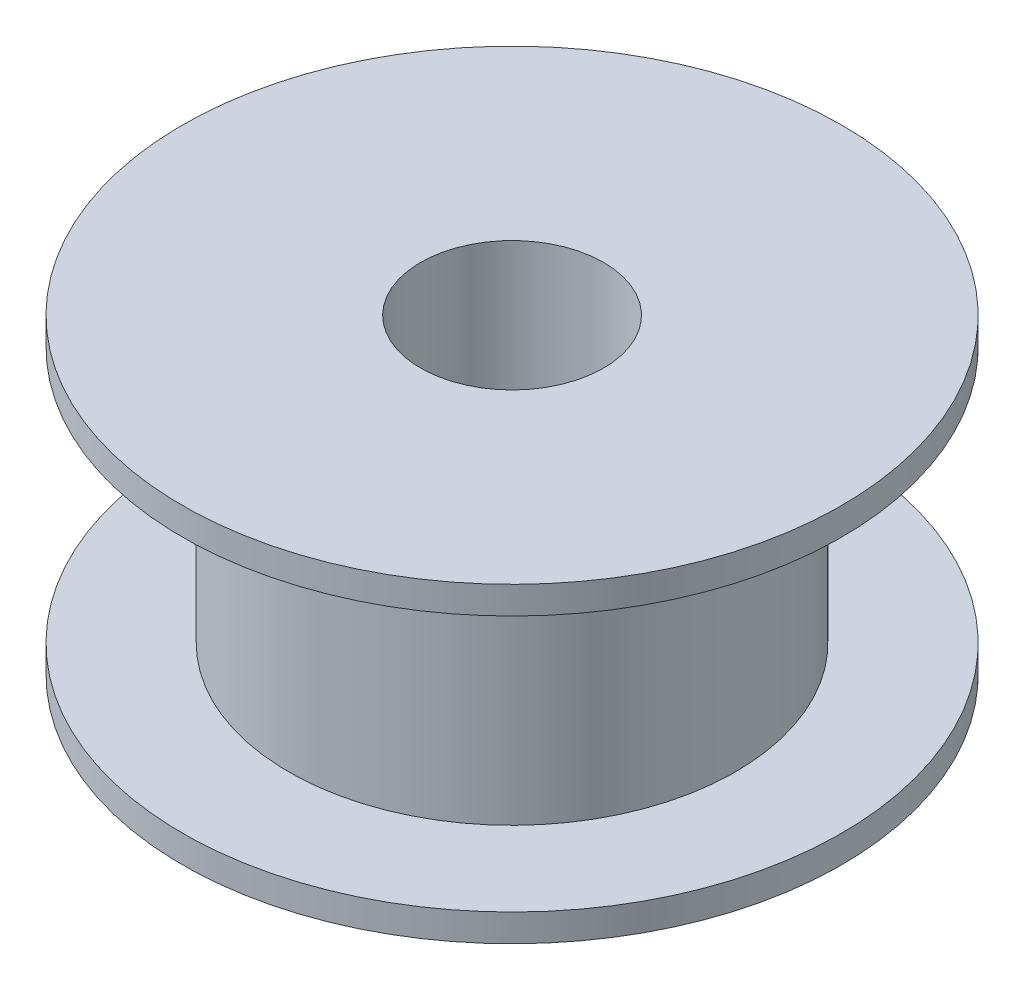
ISO-10303-21;
HEADER;
FILE_DESCRIPTION(('STEP AP214'),'2;1');
FILE_NAME('part.step','',(''),(''),'','','');
FILE_SCHEMA(('AUTOMOTIVE_DESIGN { 1 0 10303 214 1 1 1 1 }'));
ENDSEC;
DATA;
#1=APPLICATION_CONTEXT('core data for automotive mechanical design processes');
#2=APPLICATION_PROTOCOL_DEFINITION('international standard','automotive_design',2000,#1);
#3=PRODUCT_CONTEXT('',#1,'mechanical');
#4=PRODUCT('Part','Part','',(#3));
#5=PRODUCT_RELATED_PRODUCT_CATEGORY('part','',(#4));
#6=PRODUCT_DEFINITION_FORMATION('','',#4);
#7=PRODUCT_DEFINITION_CONTEXT('part definition',#1,'design');
#8=PRODUCT_DEFINITION('design','',#6,#7);
#9=PRODUCT_DEFINITION_SHAPE('','',#8);
#10=(LENGTH_UNIT() NAMED_UNIT(*) SI_UNIT(.MILLI.,.METRE.));
#11=(NAMED_UNIT(*) PLANE_ANGLE_UNIT() SI_UNIT($,.RADIAN.));
#12=(NAMED_UNIT(*) SI_UNIT($,.STERADIAN.) SOLID_ANGLE_UNIT());
#13=UNCERTAINTY_MEASURE_WITH_UNIT(LENGTH_MEASURE(1.E-05),#10,'distance_accuracy_value','');
#14=(GEOMETRIC_REPRESENTATION_CONTEXT(3) GLOBAL_UNCERTAINTY_ASSIGNED_CONTEXT((#13)) GLOBAL_UNIT_ASSIGNED_CONTEXT((#10,
#11,#12)) REPRESENTATION_CONTEXT('',''));
#15=CARTESIAN_POINT('',(0.,0.,0.));
#16=DIRECTION('',(0.,0.,1.));
#17=DIRECTION('',(1.,0.,0.));
#18=AXIS2_PLACEMENT_3D('',#15,#16,#17);
#19=CARTESIAN_POINT('',(9.,0.,0.));
#20=DIRECTION('',(0.,-1.,0.));
#21=DIRECTION('',(0.,0.,-1.));
#22=AXIS2_PLACEMENT_3D('',#19,#20,#21);
#23=PLANE('',#22);
#24=CARTESIAN_POINT('',(0.,0.,0.));
#25=DIRECTION('',(0.,-1.,0.));
#26=DIRECTION('',(0.,0.,-1.));
#27=AXIS2_PLACEMENT_3D('',#24,#25,#26);
#28=CIRCLE('',#27,9.);
#29=CARTESIAN_POINT('',(0.,0.,-9.));
#30=VERTEX_POINT('',#29);
#31=EDGE_CURVE('E72',#30,#30,#28,.T.);
#32=ORIENTED_EDGE('',*,*,#31,.T.);
#33=EDGE_LOOP('',(#32));
#34=FACE_BOUND('',#33,.T.);
#35=CARTESIAN_POINT('',(0.,0.,0.));
#36=DIRECTION('',(0.,-1.,0.));
#37=DIRECTION('',(0.,0.,-1.));
#38=AXIS2_PLACEMENT_3D('',#35,#36,#37);
#39=CIRCLE('',#38,2.5);
#40=CARTESIAN_POINT('',(0.,0.,-2.5));
#41=VERTEX_POINT('',#40);
#42=EDGE_CURVE('E10',#41,#41,#39,.T.);
#43=ORIENTED_EDGE('',*,*,#42,.F.);
#44=EDGE_LOOP('',(#43));
#45=FACE_BOUND('',#44,.T.);
#46=ADVANCED_FACE('F36',(#34,#45),#23,.T.);
#47=CARTESIAN_POINT('',(0.,0.,0.));
#48=DIRECTION('',(0.,-1.,0.));
#49=DIRECTION('',(0.,0.,-1.));
#50=AXIS2_PLACEMENT_3D('',#47,#48,#49);
#51=CYLINDRICAL_SURFACE('',#50,2.5);
#52=ORIENTED_EDGE('',*,*,#42,.T.);
#53=EDGE_LOOP('',(#52));
#54=FACE_BOUND('',#53,.T.);
#55=CARTESIAN_POINT('',(0.,8.5,0.));
#56=DIRECTION('',(0.,-1.,0.));
#57=DIRECTION('',(0.,0.,-1.));
#58=AXIS2_PLACEMENT_3D('',#55,#56,#57);
#59=CIRCLE('',#58,2.5);
#60=CARTESIAN_POINT('',(0.,8.5,-2.5));
#61=VERTEX_POINT('',#60);
#62=EDGE_CURVE('E43',#61,#61,#59,.T.);
#63=ORIENTED_EDGE('',*,*,#62,.F.);
#64=EDGE_LOOP('',(#63));
#65=FACE_BOUND('',#64,.T.);
#66=ADVANCED_FACE('F91',(#54,#65),#51,.F.);
#67=CARTESIAN_POINT('',(2.5,8.5,0.));
#68=DIRECTION('',(0.,1.,0.));
#69=DIRECTION('',(0.,0.,1.));
#70=AXIS2_PLACEMENT_3D('',#67,#68,#69);
#71=PLANE('',#70);
#72=ORIENTED_EDGE('',*,*,#62,.T.);
#73=EDGE_LOOP('',(#72));
#74=FACE_BOUND('',#73,.T.);
#75=CARTESIAN_POINT('',(0.,8.5,0.));
#76=DIRECTION('',(0.,-1.,0.));
#77=DIRECTION('',(0.,0.,-1.));
#78=AXIS2_PLACEMENT_3D('',#75,#76,#77);
#79=CIRCLE('',#78,9.);
#80=CARTESIAN_POINT('',(0.,8.5,-9.));
#81=VERTEX_POINT('',#80);
#82=EDGE_CURVE('E50',#81,#81,#79,.T.);
#83=ORIENTED_EDGE('',*,*,#82,.F.);
#84=EDGE_LOOP('',(#83));
#85=FACE_BOUND('',#84,.T.);
#86=ADVANCED_FACE('F95',(#74,#85),#71,.T.);
#87=CARTESIAN_POINT('',(0.,0.,0.));
#88=DIRECTION('',(0.,-1.,0.));
#89=DIRECTION('',(0.,0.,-1.));
#90=AXIS2_PLACEMENT_3D('',#87,#88,#89);
#91=CYLINDRICAL_SURFACE('',#90,9.);
#92=ORIENTED_EDGE('',*,*,#82,.T.);
#93=EDGE_LOOP('',(#92));
#94=FACE_BOUND('',#93,.T.);
#95=CARTESIAN_POINT('',(0.,7.75,0.));
#96=DIRECTION('',(0.,-1.,0.));
#97=DIRECTION('',(0.,0.,-1.));
#98=AXIS2_PLACEMENT_3D('',#95,#96,#97);
#99=CIRCLE('',#98,9.);
#100=CARTESIAN_POINT('',(0.,7.75,-9.));
#101=VERTEX_POINT('',#100);
#102=EDGE_CURVE('E57',#101,#101,#99,.T.);
#103=ORIENTED_EDGE('',*,*,#102,.F.);
#104=EDGE_LOOP('',(#103));
#105=FACE_BOUND('',#104,.T.);
#106=ADVANCED_FACE('F99',(#94,#105),#91,.T.);
#107=CARTESIAN_POINT('',(9.,7.75,0.));
#108=DIRECTION('',(0.,-1.,0.));
#109=DIRECTION('',(0.,0.,-1.));
#110=AXIS2_PLACEMENT_3D('',#107,#108,#109);
#111=PLANE('',#110);
#112=ORIENTED_EDGE('',*,*,#102,.T.);
#113=EDGE_LOOP('',(#112));
#114=FACE_BOUND('',#113,.T.);
#115=CARTESIAN_POINT('',(0.,7.75,0.));
#116=DIRECTION('',(0.,-1.,0.));
#117=DIRECTION('',(0.,0.,-1.));
#118=AXIS2_PLACEMENT_3D('',#115,#116,#117);
#119=CIRCLE('',#118,6.1);
#120=CARTESIAN_POINT('',(0.,7.75,-6.1));
#121=VERTEX_POINT('',#120);
#122=EDGE_CURVE('E63',#121,#121,#119,.T.);
#123=ORIENTED_EDGE('',*,*,#122,.F.);
#124=EDGE_LOOP('',(#123));
#125=FACE_BOUND('',#124,.T.);
#126=ADVANCED_FACE('F104',(#114,#125),#111,.T.);
#127=CARTESIAN_POINT('',(0.,0.,0.));
#128=DIRECTION('',(0.,-1.,0.));
#129=DIRECTION('',(0.,0.,-1.));
#130=AXIS2_PLACEMENT_3D('',#127,#128,#129);
#131=CYLINDRICAL_SURFACE('',#130,6.1);
#132=ORIENTED_EDGE('',*,*,#122,.T.);
#133=EDGE_LOOP('',(#132));
#134=FACE_BOUND('',#133,.T.);
#135=CARTESIAN_POINT('',(0.,0.75,0.));
#136=DIRECTION('',(0.,-1.,0.));
#137=DIRECTION('',(0.,0.,-1.));
#138=AXIS2_PLACEMENT_3D('',#135,#136,#137);
#139=CIRCLE('',#138,6.1);
#140=CARTESIAN_POINT('',(0.,0.75,-6.1));
#141=VERTEX_POINT('',#140);
#142=EDGE_CURVE('E66',#141,#141,#139,.T.);
#143=ORIENTED_EDGE('',*,*,#142,.F.);
#144=EDGE_LOOP('',(#143));
#145=FACE_BOUND('',#144,.T.);
#146=ADVANCED_FACE('F87',(#134,#145),#131,.T.);
#147=CARTESIAN_POINT('',(6.1,0.75,0.));
#148=DIRECTION('',(0.,1.,0.));
#149=DIRECTION('',(0.,0.,1.));
#150=AXIS2_PLACEMENT_3D('',#147,#148,#149);
#151=PLANE('',#150);
#152=ORIENTED_EDGE('',*,*,#142,.T.);
#153=EDGE_LOOP('',(#152));
#154=FACE_BOUND('',#153,.T.);
#155=CARTESIAN_POINT('',(0.,0.75,0.));
#156=DIRECTION('',(0.,-1.,0.));
#157=DIRECTION('',(0.,0.,-1.));
#158=AXIS2_PLACEMENT_3D('',#155,#156,#157);
#159=CIRCLE('',#158,9.);
#160=CARTESIAN_POINT('',(0.,0.75,-9.));
#161=VERTEX_POINT('',#160);
#162=EDGE_CURVE('E69',#161,#161,#159,.T.);
#163=ORIENTED_EDGE('',*,*,#162,.F.);
#164=EDGE_LOOP('',(#163));
#165=FACE_BOUND('',#164,.T.);
#166=ADVANCED_FACE('F80',(#154,#165),#151,.T.);
#167=CARTESIAN_POINT('',(0.,0.,0.));
#168=DIRECTION('',(0.,-1.,0.));
#169=DIRECTION('',(0.,0.,-1.));
#170=AXIS2_PLACEMENT_3D('',#167,#168,#169);
#171=CYLINDRICAL_SURFACE('',#170,9.);
#172=ORIENTED_EDGE('',*,*,#162,.T.);
#173=EDGE_LOOP('',(#172));
#174=FACE_BOUND('',#173,.T.);
#175=ORIENTED_EDGE('',*,*,#31,.F.);
#176=EDGE_LOOP('',(#175));
#177=FACE_BOUND('',#176,.T.);
#178=ADVANCED_FACE('F78',(#174,#177),#171,.T.);
#179=CLOSED_SHELL('',(#46,#66,#86,#106,#126,#146,#166,#178));
#180=MANIFOLD_SOLID_BREP('B2',#179);
#181=ADVANCED_BREP_SHAPE_REPRESENTATION('',(#18,#180),#14);
#182=SHAPE_DEFINITION_REPRESENTATION(#9,#181);
ENDSEC;
END-ISO-10303-21;
